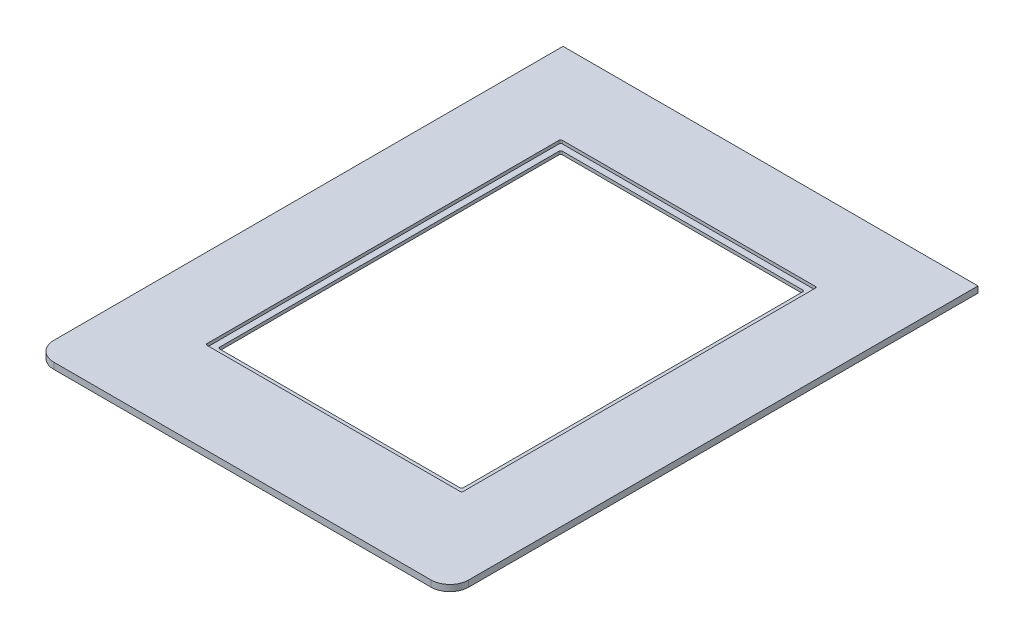
ISO-10303-21;
HEADER;
FILE_DESCRIPTION(('STEP AP214'),'2;1');
FILE_NAME('part.step','',(''),(''),'','','');
FILE_SCHEMA(('AUTOMOTIVE_DESIGN { 1 0 10303 214 1 1 1 1 }'));
ENDSEC;
DATA;
#1=APPLICATION_CONTEXT('core data for automotive mechanical design processes');
#2=APPLICATION_PROTOCOL_DEFINITION('international standard','automotive_design',2000,#1);
#3=PRODUCT_CONTEXT('',#1,'mechanical');
#4=PRODUCT('Part','Part','',(#3));
#5=PRODUCT_RELATED_PRODUCT_CATEGORY('part','',(#4));
#6=PRODUCT_DEFINITION_FORMATION('','',#4);
#7=PRODUCT_DEFINITION_CONTEXT('part definition',#1,'design');
#8=PRODUCT_DEFINITION('design','',#6,#7);
#9=PRODUCT_DEFINITION_SHAPE('','',#8);
#10=(LENGTH_UNIT() NAMED_UNIT(*) SI_UNIT(.MILLI.,.METRE.));
#11=(NAMED_UNIT(*) PLANE_ANGLE_UNIT() SI_UNIT($,.RADIAN.));
#12=(NAMED_UNIT(*) SI_UNIT($,.STERADIAN.) SOLID_ANGLE_UNIT());
#13=UNCERTAINTY_MEASURE_WITH_UNIT(LENGTH_MEASURE(1.E-05),#10,'distance_accuracy_value','');
#14=(GEOMETRIC_REPRESENTATION_CONTEXT(3) GLOBAL_UNCERTAINTY_ASSIGNED_CONTEXT((#13)) GLOBAL_UNIT_ASSIGNED_CONTEXT((#10,
#11,#12)) REPRESENTATION_CONTEXT('',''));
#15=CARTESIAN_POINT('',(0.,0.,0.));
#16=DIRECTION('',(0.,0.,1.));
#17=DIRECTION('',(1.,0.,0.));
#18=AXIS2_PLACEMENT_3D('',#15,#16,#17);
#19=CARTESIAN_POINT('',(86.51875,6.35,-444.5));
#20=DIRECTION('',(1.,0.,0.));
#21=DIRECTION('',(0.,0.,-1.));
#22=AXIS2_PLACEMENT_3D('',#19,#20,#21);
#23=PLANE('',#22);
#24=DIRECTION('',(0.,0.,1.));
#25=VECTOR('',#24,1.);
#26=CARTESIAN_POINT('',(86.51875,3.175,-444.5));
#27=LINE('',#26,#25);
#28=CARTESIAN_POINT('',(86.51875,3.175,-442.9125));
#29=VERTEX_POINT('',#28);
#30=CARTESIAN_POINT('',(86.51875,3.175,-100.0125));
#31=VERTEX_POINT('',#30);
#32=EDGE_CURVE('E330',#29,#31,#27,.T.);
#33=ORIENTED_EDGE('',*,*,#32,.T.);
#34=DIRECTION('',(0.,-1.,0.));
#35=VECTOR('',#34,1.);
#36=CARTESIAN_POINT('',(86.51875,0.,-100.0125));
#37=LINE('',#36,#35);
#38=CARTESIAN_POINT('',(86.51875,0.,-100.0125));
#39=VERTEX_POINT('',#38);
#40=EDGE_CURVE('E226',#31,#39,#37,.T.);
#41=ORIENTED_EDGE('',*,*,#40,.T.);
#42=DIRECTION('',(0.,0.,1.));
#43=VECTOR('',#42,1.);
#44=CARTESIAN_POINT('',(86.51875,0.,-444.5));
#45=LINE('',#44,#43);
#46=CARTESIAN_POINT('',(86.51875,0.,-442.9125));
#47=VERTEX_POINT('',#46);
#48=EDGE_CURVE('E327',#47,#39,#45,.T.);
#49=ORIENTED_EDGE('',*,*,#48,.F.);
#50=DIRECTION('',(0.,-1.,0.));
#51=VECTOR('',#50,1.);
#52=CARTESIAN_POINT('',(86.51875,3.175,-442.9125));
#53=LINE('',#52,#51);
#54=EDGE_CURVE('E224',#47,#29,#53,.F.);
#55=ORIENTED_EDGE('',*,*,#54,.T.);
#56=EDGE_LOOP('',(#33,#41,#49,#55));
#57=FACE_BOUND('',#56,.T.);
#58=ADVANCED_FACE('F35',(#57),#23,.T.);
#59=CARTESIAN_POINT('',(86.51875,6.35,-98.4250000000002));
#60=DIRECTION('',(0.,0.,-1.));
#61=DIRECTION('',(-1.,0.,0.));
#62=AXIS2_PLACEMENT_3D('',#59,#60,#61);
#63=PLANE('',#62);
#64=DIRECTION('',(1.,0.,0.));
#65=VECTOR('',#64,1.);
#66=CARTESIAN_POINT('',(86.51875,0.,-98.4250000000002));
#67=LINE('',#66,#65);
#68=CARTESIAN_POINT('',(88.10625,0.,-98.4250000000002));
#69=VERTEX_POINT('',#68);
#70=CARTESIAN_POINT('',(330.99375,0.,-98.4250000000002));
#71=VERTEX_POINT('',#70);
#72=EDGE_CURVE('E324',#69,#71,#67,.T.);
#73=ORIENTED_EDGE('',*,*,#72,.F.);
#74=DIRECTION('',(0.,-1.,0.));
#75=VECTOR('',#74,1.);
#76=CARTESIAN_POINT('',(88.10625,3.175,-98.4250000000002));
#77=LINE('',#76,#75);
#78=CARTESIAN_POINT('',(88.10625,3.175,-98.4250000000002));
#79=VERTEX_POINT('',#78);
#80=EDGE_CURVE('E232',#69,#79,#77,.F.);
#81=ORIENTED_EDGE('',*,*,#80,.T.);
#82=DIRECTION('',(1.,0.,0.));
#83=VECTOR('',#82,1.);
#84=CARTESIAN_POINT('',(86.51875,3.175,-98.4250000000002));
#85=LINE('',#84,#83);
#86=CARTESIAN_POINT('',(330.99375,3.175,-98.4250000000002));
#87=VERTEX_POINT('',#86);
#88=EDGE_CURVE('E333',#79,#87,#85,.T.);
#89=ORIENTED_EDGE('',*,*,#88,.T.);
#90=DIRECTION('',(0.,-1.,0.));
#91=VECTOR('',#90,1.);
#92=CARTESIAN_POINT('',(330.99375,0.,-98.4250000000002));
#93=LINE('',#92,#91);
#94=EDGE_CURVE('E229',#87,#71,#93,.T.);
#95=ORIENTED_EDGE('',*,*,#94,.T.);
#96=EDGE_LOOP('',(#73,#81,#89,#95));
#97=FACE_BOUND('',#96,.T.);
#98=ADVANCED_FACE('F412',(#97),#63,.T.);
#99=CARTESIAN_POINT('',(332.58125,6.35,-444.5));
#100=DIRECTION('',(-1.,0.,0.));
#101=DIRECTION('',(0.,0.,1.));
#102=AXIS2_PLACEMENT_3D('',#99,#100,#101);
#103=PLANE('',#102);
#104=DIRECTION('',(0.,0.,-1.));
#105=VECTOR('',#104,1.);
#106=CARTESIAN_POINT('',(332.58125,0.,-444.5));
#107=LINE('',#106,#105);
#108=CARTESIAN_POINT('',(332.58125,0.,-100.0125));
#109=VERTEX_POINT('',#108);
#110=CARTESIAN_POINT('',(332.58125,0.,-442.9125));
#111=VERTEX_POINT('',#110);
#112=EDGE_CURVE('E321',#109,#111,#107,.T.);
#113=ORIENTED_EDGE('',*,*,#112,.F.);
#114=DIRECTION('',(0.,-1.,0.));
#115=VECTOR('',#114,1.);
#116=CARTESIAN_POINT('',(332.58125,3.175,-100.0125));
#117=LINE('',#116,#115);
#118=CARTESIAN_POINT('',(332.58125,3.175,-100.0125));
#119=VERTEX_POINT('',#118);
#120=EDGE_CURVE('E237',#109,#119,#117,.F.);
#121=ORIENTED_EDGE('',*,*,#120,.T.);
#122=DIRECTION('',(0.,0.,-1.));
#123=VECTOR('',#122,1.);
#124=CARTESIAN_POINT('',(332.58125,3.175,-444.5));
#125=LINE('',#124,#123);
#126=CARTESIAN_POINT('',(332.58125,3.175,-442.9125));
#127=VERTEX_POINT('',#126);
#128=EDGE_CURVE('E336',#119,#127,#125,.T.);
#129=ORIENTED_EDGE('',*,*,#128,.T.);
#130=DIRECTION('',(0.,-1.,0.));
#131=VECTOR('',#130,1.);
#132=CARTESIAN_POINT('',(332.58125,0.,-442.9125));
#133=LINE('',#132,#131);
#134=EDGE_CURVE('E234',#127,#111,#133,.T.);
#135=ORIENTED_EDGE('',*,*,#134,.T.);
#136=EDGE_LOOP('',(#113,#121,#129,#135));
#137=FACE_BOUND('',#136,.T.);
#138=ADVANCED_FACE('F418',(#137),#103,.T.);
#139=CARTESIAN_POINT('',(86.51875,6.35,-444.5));
#140=DIRECTION('',(0.,0.,1.));
#141=DIRECTION('',(1.,0.,0.));
#142=AXIS2_PLACEMENT_3D('',#139,#140,#141);
#143=PLANE('',#142);
#144=DIRECTION('',(-1.,0.,0.));
#145=VECTOR('',#144,1.);
#146=CARTESIAN_POINT('',(86.51875,0.,-444.5));
#147=LINE('',#146,#145);
#148=CARTESIAN_POINT('',(330.99375,0.,-444.5));
#149=VERTEX_POINT('',#148);
#150=CARTESIAN_POINT('',(88.10625,0.,-444.5));
#151=VERTEX_POINT('',#150);
#152=EDGE_CURVE('E216',#149,#151,#147,.T.);
#153=ORIENTED_EDGE('',*,*,#152,.F.);
#154=DIRECTION('',(0.,-1.,0.));
#155=VECTOR('',#154,1.);
#156=CARTESIAN_POINT('',(330.99375,3.175,-444.5));
#157=LINE('',#156,#155);
#158=CARTESIAN_POINT('',(330.99375,3.175,-444.5));
#159=VERTEX_POINT('',#158);
#160=EDGE_CURVE('E242',#149,#159,#157,.F.);
#161=ORIENTED_EDGE('',*,*,#160,.T.);
#162=DIRECTION('',(-1.,0.,0.));
#163=VECTOR('',#162,1.);
#164=CARTESIAN_POINT('',(86.51875,3.175,-444.5));
#165=LINE('',#164,#163);
#166=CARTESIAN_POINT('',(88.10625,3.175,-444.5));
#167=VERTEX_POINT('',#166);
#168=EDGE_CURVE('E204',#159,#167,#165,.T.);
#169=ORIENTED_EDGE('',*,*,#168,.T.);
#170=DIRECTION('',(0.,-1.,0.));
#171=VECTOR('',#170,1.);
#172=CARTESIAN_POINT('',(88.10625,0.,-444.5));
#173=LINE('',#172,#171);
#174=EDGE_CURVE('E239',#167,#151,#173,.T.);
#175=ORIENTED_EDGE('',*,*,#174,.T.);
#176=EDGE_LOOP('',(#153,#161,#169,#175));
#177=FACE_BOUND('',#176,.T.);
#178=ADVANCED_FACE('F425',(#177),#143,.T.);
#179=CARTESIAN_POINT('',(0.,6.35,0.));
#180=DIRECTION('',(0.,-1.,0.));
#181=DIRECTION('',(0.,0.,-1.));
#182=AXIS2_PLACEMENT_3D('',#179,#180,#181);
#183=PLANE('',#182);
#184=DIRECTION('',(1.,0.,0.));
#185=VECTOR('',#184,1.);
#186=CARTESIAN_POINT('',(80.16875,6.35,-92.0750000000002));
#187=LINE('',#186,#185);
#188=CARTESIAN_POINT('',(81.75625,6.35,-92.0750000000002));
#189=VERTEX_POINT('',#188);
#190=CARTESIAN_POINT('',(337.34375,6.35,-92.0750000000002));
#191=VERTEX_POINT('',#190);
#192=EDGE_CURVE('E347',#189,#191,#187,.T.);
#193=ORIENTED_EDGE('',*,*,#192,.F.);
#194=CARTESIAN_POINT('',(81.75625,6.35,-93.6625000000002));
#195=DIRECTION('',(0.,-1.,0.));
#196=DIRECTION('',(0.,0.,-1.));
#197=AXIS2_PLACEMENT_3D('',#194,#195,#196);
#198=CIRCLE('',#197,1.5875);
#199=CARTESIAN_POINT('',(80.16875,6.35,-93.6625000000002));
#200=VERTEX_POINT('',#199);
#201=EDGE_CURVE('E290',#189,#200,#198,.T.);
#202=ORIENTED_EDGE('',*,*,#201,.T.);
#203=DIRECTION('',(0.,0.,1.));
#204=VECTOR('',#203,1.);
#205=CARTESIAN_POINT('',(80.16875,6.35,-450.85));
#206=LINE('',#205,#204);
#207=CARTESIAN_POINT('',(80.16875,6.35,-449.2625));
#208=VERTEX_POINT('',#207);
#209=EDGE_CURVE('E350',#208,#200,#206,.T.);
#210=ORIENTED_EDGE('',*,*,#209,.F.);
#211=CARTESIAN_POINT('',(81.75625,6.35,-449.2625));
#212=DIRECTION('',(0.,-1.,0.));
#213=DIRECTION('',(0.,0.,-1.));
#214=AXIS2_PLACEMENT_3D('',#211,#212,#213);
#215=CIRCLE('',#214,1.5875);
#216=CARTESIAN_POINT('',(81.75625,6.35,-450.85));
#217=VERTEX_POINT('',#216);
#218=EDGE_CURVE('E294',#208,#217,#215,.T.);
#219=ORIENTED_EDGE('',*,*,#218,.T.);
#220=DIRECTION('',(-1.,0.,0.));
#221=VECTOR('',#220,1.);
#222=CARTESIAN_POINT('',(338.93125,6.35,-450.85));
#223=LINE('',#222,#221);
#224=CARTESIAN_POINT('',(337.34375,6.35,-450.85));
#225=VERTEX_POINT('',#224);
#226=EDGE_CURVE('E340',#225,#217,#223,.T.);
#227=ORIENTED_EDGE('',*,*,#226,.F.);
#228=CARTESIAN_POINT('',(337.34375,6.35,-449.2625));
#229=DIRECTION('',(0.,-1.,0.));
#230=DIRECTION('',(0.,0.,-1.));
#231=AXIS2_PLACEMENT_3D('',#228,#229,#230);
#232=CIRCLE('',#231,1.5875);
#233=CARTESIAN_POINT('',(338.93125,6.35,-449.2625));
#234=VERTEX_POINT('',#233);
#235=EDGE_CURVE('E292',#225,#234,#232,.T.);
#236=ORIENTED_EDGE('',*,*,#235,.T.);
#237=DIRECTION('',(0.,0.,-1.));
#238=VECTOR('',#237,1.);
#239=CARTESIAN_POINT('',(338.93125,6.35,-92.0750000000002));
#240=LINE('',#239,#238);
#241=CARTESIAN_POINT('',(338.93125,6.35,-93.6625000000002));
#242=VERTEX_POINT('',#241);
#243=EDGE_CURVE('E344',#242,#234,#240,.T.);
#244=ORIENTED_EDGE('',*,*,#243,.F.);
#245=CARTESIAN_POINT('',(337.34375,6.35,-93.6625000000002));
#246=DIRECTION('',(0.,-1.,0.));
#247=DIRECTION('',(0.,0.,-1.));
#248=AXIS2_PLACEMENT_3D('',#245,#246,#247);
#249=CIRCLE('',#248,1.5875);
#250=EDGE_CURVE('E288',#242,#191,#249,.T.);
#251=ORIENTED_EDGE('',*,*,#250,.T.);
#252=EDGE_LOOP('',(#193,#202,#210,#219,#227,#236,#244,#251));
#253=FACE_BOUND('',#252,.T.);
#254=DIRECTION('',(1.,0.,0.));
#255=VECTOR('',#254,1.);
#256=CARTESIAN_POINT('',(0.,6.35,0.));
#257=LINE('',#256,#255);
#258=CARTESIAN_POINT('',(19.05,6.35,0.));
#259=VERTEX_POINT('',#258);
#260=CARTESIAN_POINT('',(400.05,6.35,0.));
#261=VERTEX_POINT('',#260);
#262=EDGE_CURVE('E195',#259,#261,#257,.T.);
#263=ORIENTED_EDGE('',*,*,#262,.T.);
#264=CARTESIAN_POINT('',(400.05,6.35,-19.0500000000001));
#265=DIRECTION('',(0.,-1.,0.));
#266=DIRECTION('',(0.,0.,-1.));
#267=AXIS2_PLACEMENT_3D('',#264,#265,#266);
#268=CIRCLE('',#267,19.05);
#269=CARTESIAN_POINT('',(419.1,6.35,-19.0500000000001));
#270=VERTEX_POINT('',#269);
#271=EDGE_CURVE('E43',#261,#270,#268,.F.);
#272=ORIENTED_EDGE('',*,*,#271,.T.);
#273=DIRECTION('',(0.,0.,-1.));
#274=VECTOR('',#273,1.);
#275=CARTESIAN_POINT('',(419.1,6.35,0.));
#276=LINE('',#275,#274);
#277=CARTESIAN_POINT('',(419.1,6.35,-533.4));
#278=VERTEX_POINT('',#277);
#279=EDGE_CURVE('E185',#270,#278,#276,.T.);
#280=ORIENTED_EDGE('',*,*,#279,.T.);
#281=DIRECTION('',(-1.,0.,0.));
#282=VECTOR('',#281,1.);
#283=CARTESIAN_POINT('',(-1.11022302462516E-13,6.35,-533.4));
#284=LINE('',#283,#282);
#285=CARTESIAN_POINT('',(-1.11022302462516E-13,6.35,-533.4));
#286=VERTEX_POINT('',#285);
#287=EDGE_CURVE('E189',#278,#286,#284,.T.);
#288=ORIENTED_EDGE('',*,*,#287,.T.);
#289=DIRECTION('',(0.,0.,1.));
#290=VECTOR('',#289,1.);
#291=CARTESIAN_POINT('',(0.,6.35,0.));
#292=LINE('',#291,#290);
#293=CARTESIAN_POINT('',(0.,6.35,-19.05));
#294=VERTEX_POINT('',#293);
#295=EDGE_CURVE('E220',#286,#294,#292,.T.);
#296=ORIENTED_EDGE('',*,*,#295,.T.);
#297=CARTESIAN_POINT('',(19.05,6.35,-19.05));
#298=DIRECTION('',(0.,-1.,0.));
#299=DIRECTION('',(0.,0.,-1.));
#300=AXIS2_PLACEMENT_3D('',#297,#298,#299);
#301=CIRCLE('',#300,19.05);
#302=EDGE_CURVE('E306',#294,#259,#301,.F.);
#303=ORIENTED_EDGE('',*,*,#302,.T.);
#304=EDGE_LOOP('',(#263,#272,#280,#288,#296,#303));
#305=FACE_BOUND('',#304,.T.);
#306=ADVANCED_FACE('F187',(#253,#305),#183,.F.);
#307=CARTESIAN_POINT('',(0.,0.,0.));
#308=DIRECTION('',(0.,-1.,0.));
#309=DIRECTION('',(0.,0.,-1.));
#310=AXIS2_PLACEMENT_3D('',#307,#308,#309);
#311=PLANE('',#310);
#312=DIRECTION('',(0.,0.,-1.));
#313=VECTOR('',#312,1.);
#314=CARTESIAN_POINT('',(419.1,0.,0.));
#315=LINE('',#314,#313);
#316=CARTESIAN_POINT('',(419.1,0.,-19.0500000000001));
#317=VERTEX_POINT('',#316);
#318=CARTESIAN_POINT('',(419.1,0.,-533.4));
#319=VERTEX_POINT('',#318);
#320=EDGE_CURVE('E201',#317,#319,#315,.T.);
#321=ORIENTED_EDGE('',*,*,#320,.F.);
#322=CARTESIAN_POINT('',(400.05,0.,-19.0500000000001));
#323=DIRECTION('',(0.,-1.,0.));
#324=DIRECTION('',(0.,0.,-1.));
#325=AXIS2_PLACEMENT_3D('',#322,#323,#324);
#326=CIRCLE('',#325,19.05);
#327=CARTESIAN_POINT('',(400.05,0.,0.));
#328=VERTEX_POINT('',#327);
#329=EDGE_CURVE('E300',#317,#328,#326,.T.);
#330=ORIENTED_EDGE('',*,*,#329,.T.);
#331=DIRECTION('',(1.,0.,0.));
#332=VECTOR('',#331,1.);
#333=CARTESIAN_POINT('',(0.,0.,0.));
#334=LINE('',#333,#332);
#335=CARTESIAN_POINT('',(19.05,0.,0.));
#336=VERTEX_POINT('',#335);
#337=EDGE_CURVE('E215',#336,#328,#334,.T.);
#338=ORIENTED_EDGE('',*,*,#337,.F.);
#339=CARTESIAN_POINT('',(19.05,0.,-19.05));
#340=DIRECTION('',(0.,-1.,0.));
#341=DIRECTION('',(0.,0.,-1.));
#342=AXIS2_PLACEMENT_3D('',#339,#340,#341);
#343=CIRCLE('',#342,19.05);
#344=CARTESIAN_POINT('',(0.,0.,-19.05));
#345=VERTEX_POINT('',#344);
#346=EDGE_CURVE('E298',#336,#345,#343,.T.);
#347=ORIENTED_EDGE('',*,*,#346,.T.);
#348=DIRECTION('',(0.,0.,1.));
#349=VECTOR('',#348,1.);
#350=CARTESIAN_POINT('',(0.,0.,0.));
#351=LINE('',#350,#349);
#352=CARTESIAN_POINT('',(-1.11022302462516E-13,0.,-533.4));
#353=VERTEX_POINT('',#352);
#354=EDGE_CURVE('E213',#353,#345,#351,.T.);
#355=ORIENTED_EDGE('',*,*,#354,.F.);
#356=DIRECTION('',(-1.,0.,0.));
#357=VECTOR('',#356,1.);
#358=CARTESIAN_POINT('',(-1.11022302462516E-13,0.,-533.4));
#359=LINE('',#358,#357);
#360=EDGE_CURVE('E219',#319,#353,#359,.T.);
#361=ORIENTED_EDGE('',*,*,#360,.F.);
#362=EDGE_LOOP('',(#321,#330,#338,#347,#355,#361));
#363=FACE_BOUND('',#362,.T.);
#364=ORIENTED_EDGE('',*,*,#112,.T.);
#365=CARTESIAN_POINT('',(330.99375,0.,-442.9125));
#366=DIRECTION('',(0.,-1.,0.));
#367=DIRECTION('',(0.,0.,-1.));
#368=AXIS2_PLACEMENT_3D('',#365,#366,#367);
#369=CIRCLE('',#368,1.5875);
#370=EDGE_CURVE('E280',#111,#149,#369,.F.);
#371=ORIENTED_EDGE('',*,*,#370,.T.);
#372=ORIENTED_EDGE('',*,*,#152,.T.);
#373=CARTESIAN_POINT('',(88.10625,0.,-442.9125));
#374=DIRECTION('',(0.,-1.,0.));
#375=DIRECTION('',(0.,0.,-1.));
#376=AXIS2_PLACEMENT_3D('',#373,#374,#375);
#377=CIRCLE('',#376,1.5875);
#378=EDGE_CURVE('E284',#151,#47,#377,.F.);
#379=ORIENTED_EDGE('',*,*,#378,.T.);
#380=ORIENTED_EDGE('',*,*,#48,.T.);
#381=CARTESIAN_POINT('',(88.10625,0.,-100.0125));
#382=DIRECTION('',(0.,-1.,0.));
#383=DIRECTION('',(0.,0.,-1.));
#384=AXIS2_PLACEMENT_3D('',#381,#382,#383);
#385=CIRCLE('',#384,1.5875);
#386=EDGE_CURVE('E272',#39,#69,#385,.F.);
#387=ORIENTED_EDGE('',*,*,#386,.T.);
#388=ORIENTED_EDGE('',*,*,#72,.T.);
#389=CARTESIAN_POINT('',(330.99375,0.,-100.0125));
#390=DIRECTION('',(0.,-1.,0.));
#391=DIRECTION('',(0.,0.,-1.));
#392=AXIS2_PLACEMENT_3D('',#389,#390,#391);
#393=CIRCLE('',#392,1.5875);
#394=EDGE_CURVE('E276',#71,#109,#393,.F.);
#395=ORIENTED_EDGE('',*,*,#394,.T.);
#396=EDGE_LOOP('',(#364,#371,#372,#379,#380,#387,#388,#395));
#397=FACE_BOUND('',#396,.T.);
#398=ADVANCED_FACE('F314',(#363,#397),#311,.T.);
#399=CARTESIAN_POINT('',(0.,6.35,0.));
#400=DIRECTION('',(1.,0.,0.));
#401=DIRECTION('',(0.,0.,-1.));
#402=AXIS2_PLACEMENT_3D('',#399,#400,#401);
#403=PLANE('',#402);
#404=ORIENTED_EDGE('',*,*,#354,.T.);
#405=DIRECTION('',(0.,-1.,0.));
#406=VECTOR('',#405,1.);
#407=CARTESIAN_POINT('',(0.,6.35,-19.05));
#408=LINE('',#407,#406);
#409=EDGE_CURVE('E11',#345,#294,#408,.F.);
#410=ORIENTED_EDGE('',*,*,#409,.T.);
#411=ORIENTED_EDGE('',*,*,#295,.F.);
#412=DIRECTION('',(0.,-1.,0.));
#413=VECTOR('',#412,1.);
#414=CARTESIAN_POINT('',(-1.11022302462516E-13,6.35,-533.4));
#415=LINE('',#414,#413);
#416=EDGE_CURVE('E205',#286,#353,#415,.T.);
#417=ORIENTED_EDGE('',*,*,#416,.T.);
#418=EDGE_LOOP('',(#404,#410,#411,#417));
#419=FACE_BOUND('',#418,.T.);
#420=ADVANCED_FACE('F316',(#419),#403,.F.);
#421=CARTESIAN_POINT('',(0.,6.35,0.));
#422=DIRECTION('',(0.,0.,-1.));
#423=DIRECTION('',(-1.,0.,0.));
#424=AXIS2_PLACEMENT_3D('',#421,#422,#423);
#425=PLANE('',#424);
#426=ORIENTED_EDGE('',*,*,#337,.T.);
#427=DIRECTION('',(0.,-1.,0.));
#428=VECTOR('',#427,1.);
#429=CARTESIAN_POINT('',(400.05,6.35,0.));
#430=LINE('',#429,#428);
#431=EDGE_CURVE('E56',#328,#261,#430,.F.);
#432=ORIENTED_EDGE('',*,*,#431,.T.);
#433=ORIENTED_EDGE('',*,*,#262,.F.);
#434=DIRECTION('',(0.,-1.,0.));
#435=VECTOR('',#434,1.);
#436=CARTESIAN_POINT('',(19.05,6.35,0.));
#437=LINE('',#436,#435);
#438=EDGE_CURVE('E302',#259,#336,#437,.T.);
#439=ORIENTED_EDGE('',*,*,#438,.T.);
#440=EDGE_LOOP('',(#426,#432,#433,#439));
#441=FACE_BOUND('',#440,.T.);
#442=ADVANCED_FACE('F310',(#441),#425,.F.);
#443=CARTESIAN_POINT('',(419.1,6.35,0.));
#444=DIRECTION('',(-1.,0.,0.));
#445=DIRECTION('',(0.,0.,1.));
#446=AXIS2_PLACEMENT_3D('',#443,#444,#445);
#447=PLANE('',#446);
#448=ORIENTED_EDGE('',*,*,#279,.F.);
#449=DIRECTION('',(0.,-1.,0.));
#450=VECTOR('',#449,1.);
#451=CARTESIAN_POINT('',(419.1,6.35,-19.0500000000001));
#452=LINE('',#451,#450);
#453=EDGE_CURVE('E296',#270,#317,#452,.T.);
#454=ORIENTED_EDGE('',*,*,#453,.T.);
#455=ORIENTED_EDGE('',*,*,#320,.T.);
#456=DIRECTION('',(0.,-1.,0.));
#457=VECTOR('',#456,1.);
#458=CARTESIAN_POINT('',(419.1,6.35,-533.4));
#459=LINE('',#458,#457);
#460=EDGE_CURVE('E198',#278,#319,#459,.T.);
#461=ORIENTED_EDGE('',*,*,#460,.F.);
#462=EDGE_LOOP('',(#448,#454,#455,#461));
#463=FACE_BOUND('',#462,.T.);
#464=ADVANCED_FACE('F199',(#463),#447,.F.);
#465=CARTESIAN_POINT('',(-1.11022302462516E-13,6.35,-533.4));
#466=DIRECTION('',(0.,0.,1.));
#467=DIRECTION('',(1.,0.,0.));
#468=AXIS2_PLACEMENT_3D('',#465,#466,#467);
#469=PLANE('',#468);
#470=ORIENTED_EDGE('',*,*,#360,.T.);
#471=ORIENTED_EDGE('',*,*,#416,.F.);
#472=ORIENTED_EDGE('',*,*,#287,.F.);
#473=ORIENTED_EDGE('',*,*,#460,.T.);
#474=EDGE_LOOP('',(#470,#471,#472,#473));
#475=FACE_BOUND('',#474,.T.);
#476=ADVANCED_FACE('F207',(#475),#469,.F.);
#477=CARTESIAN_POINT('',(80.16875,3.175,-450.85));
#478=DIRECTION('',(-1.,0.,0.));
#479=DIRECTION('',(0.,0.,1.));
#480=AXIS2_PLACEMENT_3D('',#477,#478,#479);
#481=PLANE('',#480);
#482=ORIENTED_EDGE('',*,*,#209,.T.);
#483=DIRECTION('',(0.,1.,0.));
#484=VECTOR('',#483,1.);
#485=CARTESIAN_POINT('',(80.16875,3.175,-93.6625000000002));
#486=LINE('',#485,#484);
#487=CARTESIAN_POINT('',(80.16875,3.175,-93.6625000000002));
#488=VERTEX_POINT('',#487);
#489=EDGE_CURVE('E265',#200,#488,#486,.F.);
#490=ORIENTED_EDGE('',*,*,#489,.T.);
#491=DIRECTION('',(0.,0.,1.));
#492=VECTOR('',#491,1.);
#493=CARTESIAN_POINT('',(80.16875,3.175,-450.85));
#494=LINE('',#493,#492);
#495=CARTESIAN_POINT('',(80.16875,3.175,-449.2625));
#496=VERTEX_POINT('',#495);
#497=EDGE_CURVE('E343',#496,#488,#494,.T.);
#498=ORIENTED_EDGE('',*,*,#497,.F.);
#499=DIRECTION('',(0.,1.,0.));
#500=VECTOR('',#499,1.);
#501=CARTESIAN_POINT('',(80.16875,6.35,-449.2625));
#502=LINE('',#501,#500);
#503=EDGE_CURVE('E262',#496,#208,#502,.T.);
#504=ORIENTED_EDGE('',*,*,#503,.T.);
#505=EDGE_LOOP('',(#482,#490,#498,#504));
#506=FACE_BOUND('',#505,.T.);
#507=ADVANCED_FACE('F400',(#506),#481,.F.);
#508=CARTESIAN_POINT('',(338.93125,3.175,-450.85));
#509=DIRECTION('',(0.,0.,-1.));
#510=DIRECTION('',(-1.,0.,0.));
#511=AXIS2_PLACEMENT_3D('',#508,#509,#510);
#512=PLANE('',#511);
#513=DIRECTION('',(-1.,0.,0.));
#514=VECTOR('',#513,1.);
#515=CARTESIAN_POINT('',(338.93125,3.175,-450.85));
#516=LINE('',#515,#514);
#517=CARTESIAN_POINT('',(337.34375,3.175,-450.85));
#518=VERTEX_POINT('',#517);
#519=CARTESIAN_POINT('',(81.75625,3.175,-450.85));
#520=VERTEX_POINT('',#519);
#521=EDGE_CURVE('E339',#518,#520,#516,.T.);
#522=ORIENTED_EDGE('',*,*,#521,.F.);
#523=DIRECTION('',(0.,1.,0.));
#524=VECTOR('',#523,1.);
#525=CARTESIAN_POINT('',(337.34375,6.35,-450.85));
#526=LINE('',#525,#524);
#527=EDGE_CURVE('E269',#518,#225,#526,.T.);
#528=ORIENTED_EDGE('',*,*,#527,.T.);
#529=ORIENTED_EDGE('',*,*,#226,.T.);
#530=DIRECTION('',(0.,1.,0.));
#531=VECTOR('',#530,1.);
#532=CARTESIAN_POINT('',(81.75625,3.175,-450.85));
#533=LINE('',#532,#531);
#534=EDGE_CURVE('E267',#217,#520,#533,.F.);
#535=ORIENTED_EDGE('',*,*,#534,.T.);
#536=EDGE_LOOP('',(#522,#528,#529,#535));
#537=FACE_BOUND('',#536,.T.);
#538=ADVANCED_FACE('F396',(#537),#512,.F.);
#539=CARTESIAN_POINT('',(338.93125,3.175,-92.0750000000002));
#540=DIRECTION('',(1.,0.,0.));
#541=DIRECTION('',(0.,0.,-1.));
#542=AXIS2_PLACEMENT_3D('',#539,#540,#541);
#543=PLANE('',#542);
#544=DIRECTION('',(0.,0.,-1.));
#545=VECTOR('',#544,1.);
#546=CARTESIAN_POINT('',(338.93125,3.175,-92.0750000000002));
#547=LINE('',#546,#545);
#548=CARTESIAN_POINT('',(338.93125,3.175,-93.6625000000002));
#549=VERTEX_POINT('',#548);
#550=CARTESIAN_POINT('',(338.93125,3.175,-449.2625));
#551=VERTEX_POINT('',#550);
#552=EDGE_CURVE('E355',#549,#551,#547,.T.);
#553=ORIENTED_EDGE('',*,*,#552,.F.);
#554=DIRECTION('',(0.,1.,0.));
#555=VECTOR('',#554,1.);
#556=CARTESIAN_POINT('',(338.93125,6.35,-93.6625000000002));
#557=LINE('',#556,#555);
#558=EDGE_CURVE('E246',#549,#242,#557,.T.);
#559=ORIENTED_EDGE('',*,*,#558,.T.);
#560=ORIENTED_EDGE('',*,*,#243,.T.);
#561=DIRECTION('',(0.,1.,0.));
#562=VECTOR('',#561,1.);
#563=CARTESIAN_POINT('',(338.93125,3.175,-449.2625));
#564=LINE('',#563,#562);
#565=EDGE_CURVE('E244',#234,#551,#564,.F.);
#566=ORIENTED_EDGE('',*,*,#565,.T.);
#567=EDGE_LOOP('',(#553,#559,#560,#566));
#568=FACE_BOUND('',#567,.T.);
#569=ADVANCED_FACE('F387',(#568),#543,.F.);
#570=CARTESIAN_POINT('',(80.16875,3.175,-92.0750000000002));
#571=DIRECTION('',(0.,0.,1.));
#572=DIRECTION('',(1.,0.,0.));
#573=AXIS2_PLACEMENT_3D('',#570,#571,#572);
#574=PLANE('',#573);
#575=ORIENTED_EDGE('',*,*,#192,.T.);
#576=DIRECTION('',(0.,1.,0.));
#577=VECTOR('',#576,1.);
#578=CARTESIAN_POINT('',(337.34375,3.175,-92.0750000000002));
#579=LINE('',#578,#577);
#580=CARTESIAN_POINT('',(337.34375,3.175,-92.0750000000002));
#581=VERTEX_POINT('',#580);
#582=EDGE_CURVE('E252',#191,#581,#579,.F.);
#583=ORIENTED_EDGE('',*,*,#582,.T.);
#584=DIRECTION('',(1.,0.,0.));
#585=VECTOR('',#584,1.);
#586=CARTESIAN_POINT('',(80.16875,3.175,-92.0750000000002));
#587=LINE('',#586,#585);
#588=CARTESIAN_POINT('',(81.75625,3.175,-92.0750000000002));
#589=VERTEX_POINT('',#588);
#590=EDGE_CURVE('E358',#589,#581,#587,.T.);
#591=ORIENTED_EDGE('',*,*,#590,.F.);
#592=DIRECTION('',(0.,1.,0.));
#593=VECTOR('',#592,1.);
#594=CARTESIAN_POINT('',(81.75625,6.35,-92.0750000000002));
#595=LINE('',#594,#593);
#596=EDGE_CURVE('E249',#589,#189,#595,.T.);
#597=ORIENTED_EDGE('',*,*,#596,.T.);
#598=EDGE_LOOP('',(#575,#583,#591,#597));
#599=FACE_BOUND('',#598,.T.);
#600=ADVANCED_FACE('F376',(#599),#574,.F.);
#601=CARTESIAN_POINT('',(0.,3.175,0.));
#602=DIRECTION('',(0.,1.,0.));
#603=DIRECTION('',(0.,0.,1.));
#604=AXIS2_PLACEMENT_3D('',#601,#602,#603);
#605=PLANE('',#604);
#606=ORIENTED_EDGE('',*,*,#168,.F.);
#607=CARTESIAN_POINT('',(330.99375,3.175,-442.9125));
#608=DIRECTION('',(0.,1.,0.));
#609=DIRECTION('',(0.,0.,1.));
#610=AXIS2_PLACEMENT_3D('',#607,#608,#609);
#611=CIRCLE('',#610,1.5875);
#612=EDGE_CURVE('E282',#159,#127,#611,.F.);
#613=ORIENTED_EDGE('',*,*,#612,.T.);
#614=ORIENTED_EDGE('',*,*,#128,.F.);
#615=CARTESIAN_POINT('',(330.99375,3.175,-100.0125));
#616=DIRECTION('',(0.,1.,0.));
#617=DIRECTION('',(0.,0.,1.));
#618=AXIS2_PLACEMENT_3D('',#615,#616,#617);
#619=CIRCLE('',#618,1.5875);
#620=EDGE_CURVE('E278',#119,#87,#619,.F.);
#621=ORIENTED_EDGE('',*,*,#620,.T.);
#622=ORIENTED_EDGE('',*,*,#88,.F.);
#623=CARTESIAN_POINT('',(88.10625,3.175,-100.0125));
#624=DIRECTION('',(0.,1.,0.));
#625=DIRECTION('',(0.,0.,1.));
#626=AXIS2_PLACEMENT_3D('',#623,#624,#625);
#627=CIRCLE('',#626,1.5875);
#628=EDGE_CURVE('E274',#79,#31,#627,.F.);
#629=ORIENTED_EDGE('',*,*,#628,.T.);
#630=ORIENTED_EDGE('',*,*,#32,.F.);
#631=CARTESIAN_POINT('',(88.10625,3.175,-442.9125));
#632=DIRECTION('',(0.,1.,0.));
#633=DIRECTION('',(0.,0.,1.));
#634=AXIS2_PLACEMENT_3D('',#631,#632,#633);
#635=CIRCLE('',#634,1.5875);
#636=EDGE_CURVE('E286',#29,#167,#635,.F.);
#637=ORIENTED_EDGE('',*,*,#636,.T.);
#638=EDGE_LOOP('',(#606,#613,#614,#621,#622,#629,#630,#637));
#639=FACE_BOUND('',#638,.T.);
#640=ORIENTED_EDGE('',*,*,#590,.T.);
#641=CARTESIAN_POINT('',(337.34375,3.175,-93.6625000000002));
#642=DIRECTION('',(0.,1.,0.));
#643=DIRECTION('',(0.,0.,1.));
#644=AXIS2_PLACEMENT_3D('',#641,#642,#643);
#645=CIRCLE('',#644,1.5875);
#646=EDGE_CURVE('E260',#581,#549,#645,.T.);
#647=ORIENTED_EDGE('',*,*,#646,.T.);
#648=ORIENTED_EDGE('',*,*,#552,.T.);
#649=CARTESIAN_POINT('',(337.34375,3.175,-449.2625));
#650=DIRECTION('',(0.,1.,0.));
#651=DIRECTION('',(0.,0.,1.));
#652=AXIS2_PLACEMENT_3D('',#649,#650,#651);
#653=CIRCLE('',#652,1.5875);
#654=EDGE_CURVE('E256',#551,#518,#653,.T.);
#655=ORIENTED_EDGE('',*,*,#654,.T.);
#656=ORIENTED_EDGE('',*,*,#521,.T.);
#657=CARTESIAN_POINT('',(81.75625,3.175,-449.2625));
#658=DIRECTION('',(0.,1.,0.));
#659=DIRECTION('',(0.,0.,1.));
#660=AXIS2_PLACEMENT_3D('',#657,#658,#659);
#661=CIRCLE('',#660,1.5875);
#662=EDGE_CURVE('E254',#520,#496,#661,.T.);
#663=ORIENTED_EDGE('',*,*,#662,.T.);
#664=ORIENTED_EDGE('',*,*,#497,.T.);
#665=CARTESIAN_POINT('',(81.75625,3.175,-93.6625000000002));
#666=DIRECTION('',(0.,1.,0.));
#667=DIRECTION('',(0.,0.,1.));
#668=AXIS2_PLACEMENT_3D('',#665,#666,#667);
#669=CIRCLE('',#668,1.5875);
#670=EDGE_CURVE('E258',#488,#589,#669,.T.);
#671=ORIENTED_EDGE('',*,*,#670,.T.);
#672=EDGE_LOOP('',(#640,#647,#648,#655,#656,#663,#664,#671));
#673=FACE_BOUND('',#672,.T.);
#674=ADVANCED_FACE('F365',(#639,#673),#605,.T.);
#675=CARTESIAN_POINT('',(88.10625,6.35,-100.0125));
#676=DIRECTION('',(0.,1.,0.));
#677=DIRECTION('',(0.,0.,1.));
#678=AXIS2_PLACEMENT_3D('',#675,#676,#677);
#679=CYLINDRICAL_SURFACE('',#678,1.5875);
#680=ORIENTED_EDGE('',*,*,#628,.F.);
#681=ORIENTED_EDGE('',*,*,#80,.F.);
#682=ORIENTED_EDGE('',*,*,#386,.F.);
#683=ORIENTED_EDGE('',*,*,#40,.F.);
#684=EDGE_LOOP('',(#680,#681,#682,#683));
#685=FACE_BOUND('',#684,.T.);
#686=ADVANCED_FACE('F434',(#685),#679,.F.);
#687=CARTESIAN_POINT('',(330.99375,6.35,-100.0125));
#688=DIRECTION('',(0.,1.,0.));
#689=DIRECTION('',(0.,0.,1.));
#690=AXIS2_PLACEMENT_3D('',#687,#688,#689);
#691=CYLINDRICAL_SURFACE('',#690,1.5875);
#692=ORIENTED_EDGE('',*,*,#620,.F.);
#693=ORIENTED_EDGE('',*,*,#120,.F.);
#694=ORIENTED_EDGE('',*,*,#394,.F.);
#695=ORIENTED_EDGE('',*,*,#94,.F.);
#696=EDGE_LOOP('',(#692,#693,#694,#695));
#697=FACE_BOUND('',#696,.T.);
#698=ADVANCED_FACE('F437',(#697),#691,.F.);
#699=CARTESIAN_POINT('',(330.99375,6.35,-442.9125));
#700=DIRECTION('',(0.,1.,0.));
#701=DIRECTION('',(0.,0.,1.));
#702=AXIS2_PLACEMENT_3D('',#699,#700,#701);
#703=CYLINDRICAL_SURFACE('',#702,1.5875);
#704=ORIENTED_EDGE('',*,*,#612,.F.);
#705=ORIENTED_EDGE('',*,*,#160,.F.);
#706=ORIENTED_EDGE('',*,*,#370,.F.);
#707=ORIENTED_EDGE('',*,*,#134,.F.);
#708=EDGE_LOOP('',(#704,#705,#706,#707));
#709=FACE_BOUND('',#708,.T.);
#710=ADVANCED_FACE('F441',(#709),#703,.F.);
#711=CARTESIAN_POINT('',(88.10625,6.35,-442.9125));
#712=DIRECTION('',(0.,1.,0.));
#713=DIRECTION('',(0.,0.,1.));
#714=AXIS2_PLACEMENT_3D('',#711,#712,#713);
#715=CYLINDRICAL_SURFACE('',#714,1.5875);
#716=ORIENTED_EDGE('',*,*,#636,.F.);
#717=ORIENTED_EDGE('',*,*,#54,.F.);
#718=ORIENTED_EDGE('',*,*,#378,.F.);
#719=ORIENTED_EDGE('',*,*,#174,.F.);
#720=EDGE_LOOP('',(#716,#717,#718,#719));
#721=FACE_BOUND('',#720,.T.);
#722=ADVANCED_FACE('F445',(#721),#715,.F.);
#723=CARTESIAN_POINT('',(337.34375,3.175,-93.6625000000002));
#724=DIRECTION('',(0.,-1.,0.));
#725=DIRECTION('',(0.,0.,-1.));
#726=AXIS2_PLACEMENT_3D('',#723,#724,#725);
#727=CYLINDRICAL_SURFACE('',#726,1.5875);
#728=ORIENTED_EDGE('',*,*,#646,.F.);
#729=ORIENTED_EDGE('',*,*,#582,.F.);
#730=ORIENTED_EDGE('',*,*,#250,.F.);
#731=ORIENTED_EDGE('',*,*,#558,.F.);
#732=EDGE_LOOP('',(#728,#729,#730,#731));
#733=FACE_BOUND('',#732,.T.);
#734=ADVANCED_FACE('F384',(#733),#727,.F.);
#735=CARTESIAN_POINT('',(81.75625,3.175,-93.6625000000002));
#736=DIRECTION('',(0.,-1.,0.));
#737=DIRECTION('',(0.,0.,-1.));
#738=AXIS2_PLACEMENT_3D('',#735,#736,#737);
#739=CYLINDRICAL_SURFACE('',#738,1.5875);
#740=ORIENTED_EDGE('',*,*,#670,.F.);
#741=ORIENTED_EDGE('',*,*,#489,.F.);
#742=ORIENTED_EDGE('',*,*,#201,.F.);
#743=ORIENTED_EDGE('',*,*,#596,.F.);
#744=EDGE_LOOP('',(#740,#741,#742,#743));
#745=FACE_BOUND('',#744,.T.);
#746=ADVANCED_FACE('F373',(#745),#739,.F.);
#747=CARTESIAN_POINT('',(337.34375,3.175,-449.2625));
#748=DIRECTION('',(0.,-1.,0.));
#749=DIRECTION('',(0.,0.,-1.));
#750=AXIS2_PLACEMENT_3D('',#747,#748,#749);
#751=CYLINDRICAL_SURFACE('',#750,1.5875);
#752=ORIENTED_EDGE('',*,*,#654,.F.);
#753=ORIENTED_EDGE('',*,*,#565,.F.);
#754=ORIENTED_EDGE('',*,*,#235,.F.);
#755=ORIENTED_EDGE('',*,*,#527,.F.);
#756=EDGE_LOOP('',(#752,#753,#754,#755));
#757=FACE_BOUND('',#756,.T.);
#758=ADVANCED_FACE('F393',(#757),#751,.F.);
#759=CARTESIAN_POINT('',(81.75625,3.175,-449.2625));
#760=DIRECTION('',(0.,-1.,0.));
#761=DIRECTION('',(0.,0.,-1.));
#762=AXIS2_PLACEMENT_3D('',#759,#760,#761);
#763=CYLINDRICAL_SURFACE('',#762,1.5875);
#764=ORIENTED_EDGE('',*,*,#662,.F.);
#765=ORIENTED_EDGE('',*,*,#534,.F.);
#766=ORIENTED_EDGE('',*,*,#218,.F.);
#767=ORIENTED_EDGE('',*,*,#503,.F.);
#768=EDGE_LOOP('',(#764,#765,#766,#767));
#769=FACE_BOUND('',#768,.T.);
#770=ADVANCED_FACE('F399',(#769),#763,.F.);
#771=CARTESIAN_POINT('',(400.05,6.35,-19.0500000000001));
#772=DIRECTION('',(0.,-1.,0.));
#773=DIRECTION('',(0.,0.,-1.));
#774=AXIS2_PLACEMENT_3D('',#771,#772,#773);
#775=CYLINDRICAL_SURFACE('',#774,19.05);
#776=ORIENTED_EDGE('',*,*,#271,.F.);
#777=ORIENTED_EDGE('',*,*,#431,.F.);
#778=ORIENTED_EDGE('',*,*,#329,.F.);
#779=ORIENTED_EDGE('',*,*,#453,.F.);
#780=EDGE_LOOP('',(#776,#777,#778,#779));
#781=FACE_BOUND('',#780,.T.);
#782=ADVANCED_FACE('F457',(#781),#775,.T.);
#783=CARTESIAN_POINT('',(19.05,6.35,-19.05));
#784=DIRECTION('',(0.,-1.,0.));
#785=DIRECTION('',(0.,0.,-1.));
#786=AXIS2_PLACEMENT_3D('',#783,#784,#785);
#787=CYLINDRICAL_SURFACE('',#786,19.05);
#788=ORIENTED_EDGE('',*,*,#302,.F.);
#789=ORIENTED_EDGE('',*,*,#409,.F.);
#790=ORIENTED_EDGE('',*,*,#346,.F.);
#791=ORIENTED_EDGE('',*,*,#438,.F.);
#792=EDGE_LOOP('',(#788,#789,#790,#791));
#793=FACE_BOUND('',#792,.T.);
#794=ADVANCED_FACE('F37',(#793),#787,.T.);
#795=CLOSED_SHELL('',(#58,#98,#138,#178,#306,#398,#420,#442,#464,#476,#507,#538,#569,#600,#674,
#686,#698,#710,#722,#734,#746,#758,#770,#782,#794));
#796=MANIFOLD_SOLID_BREP('B2',#795);
#797=ADVANCED_BREP_SHAPE_REPRESENTATION('',(#18,#796),#14);
#798=SHAPE_DEFINITION_REPRESENTATION(#9,#797);
ENDSEC;
END-ISO-10303-21;
